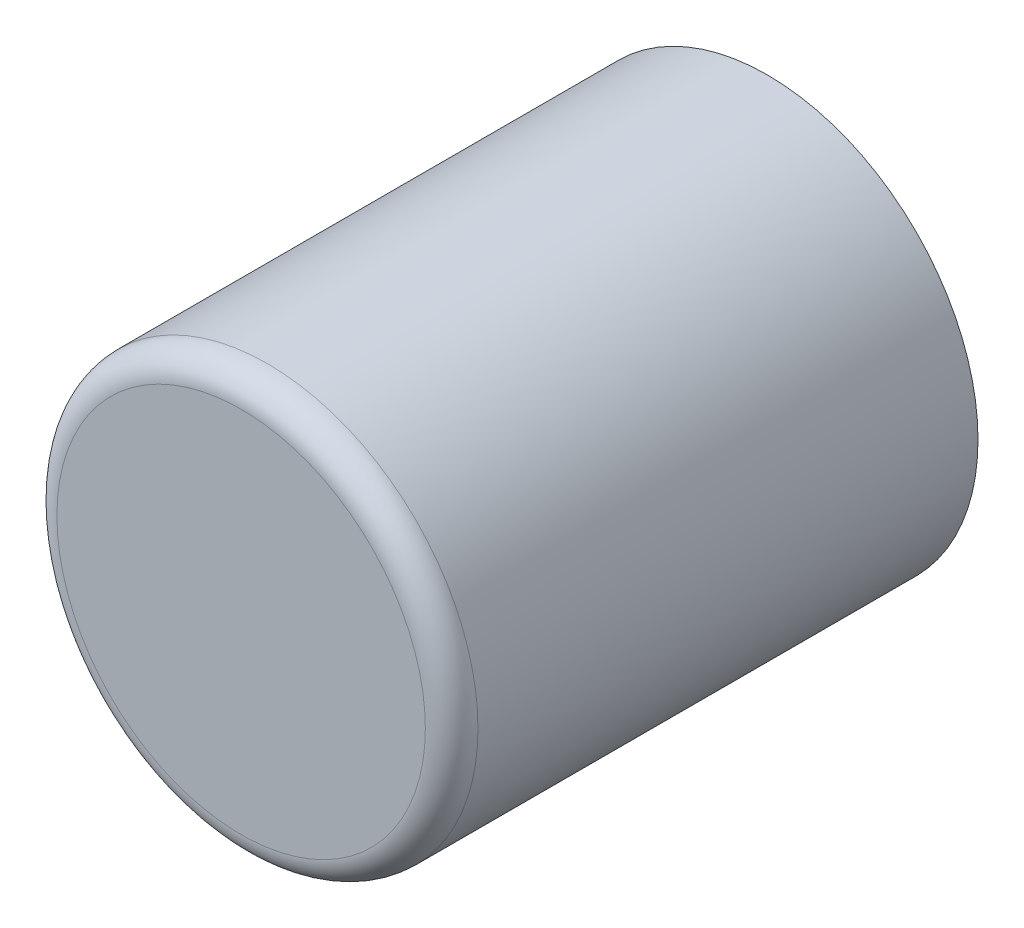
ISO-10303-21;
HEADER;
FILE_DESCRIPTION(('STEP AP214'),'2;1');
FILE_NAME('part.step','',(''),(''),'','','');
FILE_SCHEMA(('AUTOMOTIVE_DESIGN { 1 0 10303 214 1 1 1 1 }'));
ENDSEC;
DATA;
#1=APPLICATION_CONTEXT('core data for automotive mechanical design processes');
#2=APPLICATION_PROTOCOL_DEFINITION('international standard','automotive_design',2000,#1);
#3=PRODUCT_CONTEXT('',#1,'mechanical');
#4=PRODUCT('Part','Part','',(#3));
#5=PRODUCT_RELATED_PRODUCT_CATEGORY('part','',(#4));
#6=PRODUCT_DEFINITION_FORMATION('','',#4);
#7=PRODUCT_DEFINITION_CONTEXT('part definition',#1,'design');
#8=PRODUCT_DEFINITION('design','',#6,#7);
#9=PRODUCT_DEFINITION_SHAPE('','',#8);
#10=(LENGTH_UNIT() NAMED_UNIT(*) SI_UNIT(.MILLI.,.METRE.));
#11=(NAMED_UNIT(*) PLANE_ANGLE_UNIT() SI_UNIT($,.RADIAN.));
#12=(NAMED_UNIT(*) SI_UNIT($,.STERADIAN.) SOLID_ANGLE_UNIT());
#13=UNCERTAINTY_MEASURE_WITH_UNIT(LENGTH_MEASURE(1.E-05),#10,'distance_accuracy_value','');
#14=(GEOMETRIC_REPRESENTATION_CONTEXT(3) GLOBAL_UNCERTAINTY_ASSIGNED_CONTEXT((#13)) GLOBAL_UNIT_ASSIGNED_CONTEXT((#10,
#11,#12)) REPRESENTATION_CONTEXT('',''));
#15=CARTESIAN_POINT('',(0.,0.,0.));
#16=DIRECTION('',(0.,0.,1.));
#17=DIRECTION('',(1.,0.,0.));
#18=AXIS2_PLACEMENT_3D('',#15,#16,#17);
#19=CARTESIAN_POINT('',(0.,0.,10.));
#20=DIRECTION('',(0.,0.,-1.));
#21=DIRECTION('',(-1.,0.,0.));
#22=AXIS2_PLACEMENT_3D('',#19,#20,#21);
#23=CYLINDRICAL_SURFACE('',#22,4.);
#24=CARTESIAN_POINT('',(0.,0.,9.5));
#25=DIRECTION('',(0.,0.,1.));
#26=DIRECTION('',(1.,0.,0.));
#27=AXIS2_PLACEMENT_3D('',#24,#25,#26);
#28=CIRCLE('',#27,4.);
#29=CARTESIAN_POINT('',(4.,0.,9.5));
#30=VERTEX_POINT('',#29);
#31=EDGE_CURVE('E11',#30,#30,#28,.F.);
#32=ORIENTED_EDGE('',*,*,#31,.T.);
#33=EDGE_LOOP('',(#32));
#34=FACE_BOUND('',#33,.T.);
#35=CARTESIAN_POINT('',(0.,0.,0.));
#36=DIRECTION('',(0.,0.,1.));
#37=DIRECTION('',(1.,0.,0.));
#38=AXIS2_PLACEMENT_3D('',#35,#36,#37);
#39=CIRCLE('',#38,4.);
#40=CARTESIAN_POINT('',(4.,0.,0.));
#41=VERTEX_POINT('',#40);
#42=EDGE_CURVE('E72',#41,#41,#39,.T.);
#43=ORIENTED_EDGE('',*,*,#42,.T.);
#44=EDGE_LOOP('',(#43));
#45=FACE_BOUND('',#44,.T.);
#46=ADVANCED_FACE('F39',(#34,#45),#23,.T.);
#47=CARTESIAN_POINT('',(0.,0.,10.));
#48=DIRECTION('',(0.,0.,1.));
#49=DIRECTION('',(1.,0.,0.));
#50=AXIS2_PLACEMENT_3D('',#47,#48,#49);
#51=PLANE('',#50);
#52=CARTESIAN_POINT('',(0.,0.,10.));
#53=DIRECTION('',(0.,0.,1.));
#54=DIRECTION('',(1.,0.,0.));
#55=AXIS2_PLACEMENT_3D('',#52,#53,#54);
#56=CIRCLE('',#55,3.5);
#57=CARTESIAN_POINT('',(3.5,0.,10.));
#58=VERTEX_POINT('',#57);
#59=EDGE_CURVE('E48',#58,#58,#56,.T.);
#60=ORIENTED_EDGE('',*,*,#59,.T.);
#61=EDGE_LOOP('',(#60));
#62=FACE_BOUND('',#61,.T.);
#63=ADVANCED_FACE('F97',(#62),#51,.T.);
#64=CARTESIAN_POINT('',(0.,0.,0.));
#65=DIRECTION('',(0.,0.,1.));
#66=DIRECTION('',(1.,0.,0.));
#67=AXIS2_PLACEMENT_3D('',#64,#65,#66);
#68=PLANE('',#67);
#69=DIRECTION('',(-1.,0.,0.));
#70=VECTOR('',#69,1.);
#71=CARTESIAN_POINT('',(2.59807621135332,-1.5,0.));
#72=LINE('',#71,#70);
#73=CARTESIAN_POINT('',(2.59807621135332,-1.5,0.));
#74=VERTEX_POINT('',#73);
#75=CARTESIAN_POINT('',(-2.59807621135332,-1.5,0.));
#76=VERTEX_POINT('',#75);
#77=EDGE_CURVE('E76',#74,#76,#72,.T.);
#78=ORIENTED_EDGE('',*,*,#77,.F.);
#79=CARTESIAN_POINT('',(0.,0.,0.));
#80=DIRECTION('',(0.,0.,-1.));
#81=DIRECTION('',(-1.,0.,0.));
#82=AXIS2_PLACEMENT_3D('',#79,#80,#81);
#83=CIRCLE('',#82,3.);
#84=EDGE_CURVE('E55',#76,#74,#83,.T.);
#85=ORIENTED_EDGE('',*,*,#84,.F.);
#86=EDGE_LOOP('',(#78,#85));
#87=FACE_BOUND('',#86,.T.);
#88=ORIENTED_EDGE('',*,*,#42,.F.);
#89=EDGE_LOOP('',(#88));
#90=FACE_BOUND('',#89,.T.);
#91=ADVANCED_FACE('F81',(#87,#90),#68,.F.);
#92=CARTESIAN_POINT('',(0.,0.,8.));
#93=DIRECTION('',(0.,0.,-1.));
#94=DIRECTION('',(-1.,0.,0.));
#95=AXIS2_PLACEMENT_3D('',#92,#93,#94);
#96=CYLINDRICAL_SURFACE('',#95,3.);
#97=ORIENTED_EDGE('',*,*,#84,.T.);
#98=DIRECTION('',(0.,0.,-1.));
#99=VECTOR('',#98,1.);
#100=CARTESIAN_POINT('',(2.59807621135332,-1.5,8.));
#101=LINE('',#100,#99);
#102=CARTESIAN_POINT('',(2.59807621135332,-1.5,8.));
#103=VERTEX_POINT('',#102);
#104=EDGE_CURVE('E73',#103,#74,#101,.T.);
#105=ORIENTED_EDGE('',*,*,#104,.F.);
#106=CARTESIAN_POINT('',(0.,0.,8.));
#107=DIRECTION('',(0.,0.,-1.));
#108=DIRECTION('',(-1.,0.,0.));
#109=AXIS2_PLACEMENT_3D('',#106,#107,#108);
#110=CIRCLE('',#109,3.);
#111=CARTESIAN_POINT('',(-2.59807621135332,-1.5,8.));
#112=VERTEX_POINT('',#111);
#113=EDGE_CURVE('E69',#112,#103,#110,.T.);
#114=ORIENTED_EDGE('',*,*,#113,.F.);
#115=DIRECTION('',(0.,0.,-1.));
#116=VECTOR('',#115,1.);
#117=CARTESIAN_POINT('',(-2.59807621135332,-1.5,8.));
#118=LINE('',#117,#116);
#119=EDGE_CURVE('E63',#112,#76,#118,.T.);
#120=ORIENTED_EDGE('',*,*,#119,.T.);
#121=EDGE_LOOP('',(#97,#105,#114,#120));
#122=FACE_BOUND('',#121,.T.);
#123=ADVANCED_FACE('F67',(#122),#96,.F.);
#124=CARTESIAN_POINT('',(2.59807621135332,-1.5,8.));
#125=DIRECTION('',(0.,-1.,0.));
#126=DIRECTION('',(0.,0.,-1.));
#127=AXIS2_PLACEMENT_3D('',#124,#125,#126);
#128=PLANE('',#127);
#129=ORIENTED_EDGE('',*,*,#77,.T.);
#130=ORIENTED_EDGE('',*,*,#119,.F.);
#131=DIRECTION('',(-1.,0.,0.));
#132=VECTOR('',#131,1.);
#133=CARTESIAN_POINT('',(2.59807621135332,-1.5,8.));
#134=LINE('',#133,#132);
#135=EDGE_CURVE('E86',#103,#112,#134,.T.);
#136=ORIENTED_EDGE('',*,*,#135,.F.);
#137=ORIENTED_EDGE('',*,*,#104,.T.);
#138=EDGE_LOOP('',(#129,#130,#136,#137));
#139=FACE_BOUND('',#138,.T.);
#140=ADVANCED_FACE('F77',(#139),#128,.F.);
#141=CARTESIAN_POINT('',(0.,0.,8.));
#142=DIRECTION('',(0.,0.,-1.));
#143=DIRECTION('',(-1.,0.,0.));
#144=AXIS2_PLACEMENT_3D('',#141,#142,#143);
#145=PLANE('',#144);
#146=ORIENTED_EDGE('',*,*,#113,.T.);
#147=ORIENTED_EDGE('',*,*,#135,.T.);
#148=EDGE_LOOP('',(#146,#147));
#149=FACE_BOUND('',#148,.T.);
#150=ADVANCED_FACE('F100',(#149),#145,.T.);
#151=CARTESIAN_POINT('',(0.,0.,9.5));
#152=DIRECTION('',(0.,0.,1.));
#153=DIRECTION('',(1.,0.,0.));
#154=AXIS2_PLACEMENT_3D('',#151,#152,#153);
#155=TOROIDAL_SURFACE('',#154,3.5,0.5);
#156=ORIENTED_EDGE('',*,*,#31,.F.);
#157=EDGE_LOOP('',(#156));
#158=FACE_BOUND('',#157,.T.);
#159=ORIENTED_EDGE('',*,*,#59,.F.);
#160=EDGE_LOOP('',(#159));
#161=FACE_BOUND('',#160,.T.);
#162=ADVANCED_FACE('F41',(#158,#161),#155,.T.);
#163=CLOSED_SHELL('',(#46,#63,#91,#123,#140,#150,#162));
#164=MANIFOLD_SOLID_BREP('B2',#163);
#165=ADVANCED_BREP_SHAPE_REPRESENTATION('',(#18,#164),#14);
#166=SHAPE_DEFINITION_REPRESENTATION(#9,#165);
ENDSEC;
END-ISO-10303-21;
